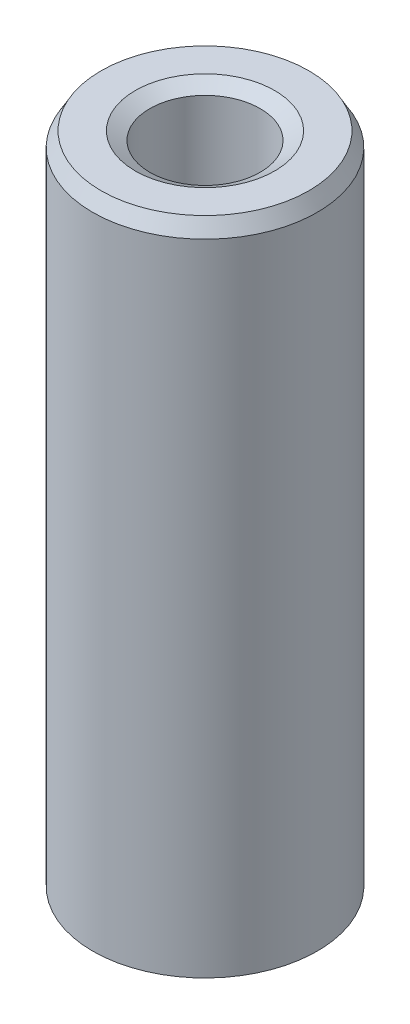
ISO-10303-21;
HEADER;
FILE_DESCRIPTION(('STEP AP214'),'2;1');
FILE_NAME('part.step','',(''),(''),'','','');
FILE_SCHEMA(('AUTOMOTIVE_DESIGN { 1 0 10303 214 1 1 1 1 }'));
ENDSEC;
DATA;
#1=APPLICATION_CONTEXT('core data for automotive mechanical design processes');
#2=APPLICATION_PROTOCOL_DEFINITION('international standard','automotive_design',2000,#1);
#3=PRODUCT_CONTEXT('',#1,'mechanical');
#4=PRODUCT('Part','Part','',(#3));
#5=PRODUCT_RELATED_PRODUCT_CATEGORY('part','',(#4));
#6=PRODUCT_DEFINITION_FORMATION('','',#4);
#7=PRODUCT_DEFINITION_CONTEXT('part definition',#1,'design');
#8=PRODUCT_DEFINITION('design','',#6,#7);
#9=PRODUCT_DEFINITION_SHAPE('','',#8);
#10=(LENGTH_UNIT() NAMED_UNIT(*) SI_UNIT(.MILLI.,.METRE.));
#11=(NAMED_UNIT(*) PLANE_ANGLE_UNIT() SI_UNIT($,.RADIAN.));
#12=(NAMED_UNIT(*) SI_UNIT($,.STERADIAN.) SOLID_ANGLE_UNIT());
#13=UNCERTAINTY_MEASURE_WITH_UNIT(LENGTH_MEASURE(1.E-05),#10,'distance_accuracy_value','');
#14=(GEOMETRIC_REPRESENTATION_CONTEXT(3) GLOBAL_UNCERTAINTY_ASSIGNED_CONTEXT((#13)) GLOBAL_UNIT_ASSIGNED_CONTEXT((#10,
#11,#12)) REPRESENTATION_CONTEXT('',''));
#15=CARTESIAN_POINT('',(0.,0.,0.));
#16=DIRECTION('',(0.,0.,1.));
#17=DIRECTION('',(1.,0.,0.));
#18=AXIS2_PLACEMENT_3D('',#15,#16,#17);
#19=CARTESIAN_POINT('',(0.,118.010384903791,0.));
#20=DIRECTION('',(0.,-1.,0.));
#21=DIRECTION('',(0.,0.,-1.));
#22=AXIS2_PLACEMENT_3D('',#19,#20,#21);
#23=CYLINDRICAL_SURFACE('',#22,20.);
#24=CARTESIAN_POINT('',(0.,1.49350604881163,0.));
#25=DIRECTION('',(0.,1.,0.));
#26=DIRECTION('',(0.,0.,1.));
#27=AXIS2_PLACEMENT_3D('',#24,#25,#26);
#28=CIRCLE('',#27,20.);
#29=CARTESIAN_POINT('',(0.,1.49350604881163,20.));
#30=VERTEX_POINT('',#29);
#31=EDGE_CURVE('E10',#30,#30,#28,.T.);
#32=ORIENTED_EDGE('',*,*,#31,.T.);
#33=EDGE_LOOP('',(#32));
#34=FACE_BOUND('',#33,.T.);
#35=CARTESIAN_POINT('',(0.,115.423556545838,0.));
#36=DIRECTION('',(0.,1.,0.));
#37=DIRECTION('',(0.,0.,1.));
#38=AXIS2_PLACEMENT_3D('',#35,#36,#37);
#39=CIRCLE('',#38,20.);
#40=CARTESIAN_POINT('',(0.,115.423556545838,20.));
#41=VERTEX_POINT('',#40);
#42=EDGE_CURVE('E50',#41,#41,#39,.F.);
#43=ORIENTED_EDGE('',*,*,#42,.T.);
#44=EDGE_LOOP('',(#43));
#45=FACE_BOUND('',#44,.T.);
#46=ADVANCED_FACE('F39',(#34,#45),#23,.T.);
#47=CARTESIAN_POINT('',(0.,118.010384903791,0.));
#48=DIRECTION('',(0.,1.,0.));
#49=DIRECTION('',(0.,0.,1.));
#50=AXIS2_PLACEMENT_3D('',#47,#48,#49);
#51=PLANE('',#50);
#52=CARTESIAN_POINT('',(0.,118.010384903791,0.));
#53=DIRECTION('',(0.,1.,0.));
#54=DIRECTION('',(0.,0.,1.));
#55=AXIS2_PLACEMENT_3D('',#52,#53,#54);
#56=CIRCLE('',#55,12.4172702866441);
#57=CARTESIAN_POINT('',(0.,118.010384903791,12.4172702866441));
#58=VERTEX_POINT('',#57);
#59=EDGE_CURVE('E58',#58,#58,#56,.F.);
#60=ORIENTED_EDGE('',*,*,#59,.T.);
#61=EDGE_LOOP('',(#60));
#62=FACE_BOUND('',#61,.T.);
#63=CARTESIAN_POINT('',(0.,118.010384903791,0.));
#64=DIRECTION('',(0.,1.,0.));
#65=DIRECTION('',(0.,0.,1.));
#66=AXIS2_PLACEMENT_3D('',#63,#64,#65);
#67=CIRCLE('',#66,18.5064939511884);
#68=CARTESIAN_POINT('',(0.,118.010384903791,18.5064939511884));
#69=VERTEX_POINT('',#68);
#70=EDGE_CURVE('E61',#69,#69,#67,.T.);
#71=ORIENTED_EDGE('',*,*,#70,.T.);
#72=EDGE_LOOP('',(#71));
#73=FACE_BOUND('',#72,.T.);
#74=ADVANCED_FACE('F88',(#62,#73),#51,.T.);
#75=CARTESIAN_POINT('',(0.,0.,0.));
#76=DIRECTION('',(0.,1.,0.));
#77=DIRECTION('',(0.,0.,1.));
#78=AXIS2_PLACEMENT_3D('',#75,#76,#77);
#79=PLANE('',#78);
#80=CARTESIAN_POINT('',(0.,0.,0.));
#81=DIRECTION('',(0.,1.,0.));
#82=DIRECTION('',(0.,0.,1.));
#83=AXIS2_PLACEMENT_3D('',#80,#81,#82);
#84=CIRCLE('',#83,11.3239479775025);
#85=CARTESIAN_POINT('',(0.,0.,11.3239479775025));
#86=VERTEX_POINT('',#85);
#87=EDGE_CURVE('E51',#86,#86,#84,.T.);
#88=ORIENTED_EDGE('',*,*,#87,.T.);
#89=EDGE_LOOP('',(#88));
#90=FACE_BOUND('',#89,.T.);
#91=CARTESIAN_POINT('',(0.,0.,0.));
#92=DIRECTION('',(0.,1.,0.));
#93=DIRECTION('',(0.,0.,1.));
#94=AXIS2_PLACEMENT_3D('',#91,#92,#93);
#95=CIRCLE('',#94,17.4131716420468);
#96=CARTESIAN_POINT('',(0.,0.,17.4131716420468));
#97=VERTEX_POINT('',#96);
#98=EDGE_CURVE('E54',#97,#97,#95,.F.);
#99=ORIENTED_EDGE('',*,*,#98,.T.);
#100=EDGE_LOOP('',(#99));
#101=FACE_BOUND('',#100,.T.);
#102=ADVANCED_FACE('F83',(#90,#101),#79,.F.);
#103=CARTESIAN_POINT('',(0.,118.010384903791,0.));
#104=DIRECTION('',(0.,-1.,0.));
#105=DIRECTION('',(0.,0.,-1.));
#106=AXIS2_PLACEMENT_3D('',#103,#104,#105);
#107=CYLINDRICAL_SURFACE('',#106,9.8304419286909);
#108=CARTESIAN_POINT('',(0.,116.51687885498,0.));
#109=DIRECTION('',(0.,1.,0.));
#110=DIRECTION('',(0.,0.,1.));
#111=AXIS2_PLACEMENT_3D('',#108,#109,#110);
#112=CIRCLE('',#111,9.8304419286909);
#113=CARTESIAN_POINT('',(0.,116.51687885498,9.8304419286909));
#114=VERTEX_POINT('',#113);
#115=EDGE_CURVE('E67',#114,#114,#112,.T.);
#116=ORIENTED_EDGE('',*,*,#115,.T.);
#117=EDGE_LOOP('',(#116));
#118=FACE_BOUND('',#117,.T.);
#119=CARTESIAN_POINT('',(0.,2.58682835795322,0.));
#120=DIRECTION('',(0.,1.,0.));
#121=DIRECTION('',(0.,0.,1.));
#122=AXIS2_PLACEMENT_3D('',#119,#120,#121);
#123=CIRCLE('',#122,9.8304419286909);
#124=CARTESIAN_POINT('',(0.,2.58682835795322,9.8304419286909));
#125=VERTEX_POINT('',#124);
#126=EDGE_CURVE('E69',#125,#125,#123,.F.);
#127=ORIENTED_EDGE('',*,*,#126,.T.);
#128=EDGE_LOOP('',(#127));
#129=FACE_BOUND('',#128,.T.);
#130=ADVANCED_FACE('F71',(#118,#129),#107,.F.);
#131=CARTESIAN_POINT('',(0.,116.51687885498,0.));
#132=DIRECTION('',(0.,1.,0.));
#133=DIRECTION('',(0.,0.,1.));
#134=AXIS2_PLACEMENT_3D('',#131,#132,#133);
#135=CONICAL_SURFACE('',#134,9.8304419286909,1.04719755119661);
#136=ORIENTED_EDGE('',*,*,#59,.F.);
#137=EDGE_LOOP('',(#136));
#138=FACE_BOUND('',#137,.T.);
#139=ORIENTED_EDGE('',*,*,#115,.F.);
#140=EDGE_LOOP('',(#139));
#141=FACE_BOUND('',#140,.T.);
#142=ADVANCED_FACE('F77',(#138,#141),#135,.F.);
#143=CARTESIAN_POINT('',(0.,0.,0.));
#144=DIRECTION('',(0.,-1.,0.));
#145=DIRECTION('',(0.,0.,-1.));
#146=AXIS2_PLACEMENT_3D('',#143,#144,#145);
#147=CONICAL_SURFACE('',#146,11.3239479775025,0.523598775598295);
#148=ORIENTED_EDGE('',*,*,#126,.F.);
#149=EDGE_LOOP('',(#148));
#150=FACE_BOUND('',#149,.T.);
#151=ORIENTED_EDGE('',*,*,#87,.F.);
#152=EDGE_LOOP('',(#151));
#153=FACE_BOUND('',#152,.T.);
#154=ADVANCED_FACE('F73',(#150,#153),#147,.F.);
#155=CARTESIAN_POINT('',(0.,1.49350604881163,0.));
#156=DIRECTION('',(0.,1.,0.));
#157=DIRECTION('',(0.,0.,1.));
#158=AXIS2_PLACEMENT_3D('',#155,#156,#157);
#159=CONICAL_SURFACE('',#158,20.,1.0471975511966);
#160=ORIENTED_EDGE('',*,*,#98,.F.);
#161=EDGE_LOOP('',(#160));
#162=FACE_BOUND('',#161,.T.);
#163=ORIENTED_EDGE('',*,*,#31,.F.);
#164=EDGE_LOOP('',(#163));
#165=FACE_BOUND('',#164,.T.);
#166=ADVANCED_FACE('F76',(#162,#165),#159,.T.);
#167=CARTESIAN_POINT('',(0.,118.010384903791,0.));
#168=DIRECTION('',(0.,-1.,0.));
#169=DIRECTION('',(0.,0.,-1.));
#170=AXIS2_PLACEMENT_3D('',#167,#168,#169);
#171=CONICAL_SURFACE('',#170,18.5064939511884,0.5235987755983);
#172=ORIENTED_EDGE('',*,*,#42,.F.);
#173=EDGE_LOOP('',(#172));
#174=FACE_BOUND('',#173,.T.);
#175=ORIENTED_EDGE('',*,*,#70,.F.);
#176=EDGE_LOOP('',(#175));
#177=FACE_BOUND('',#176,.T.);
#178=ADVANCED_FACE('F45',(#174,#177),#171,.T.);
#179=CLOSED_SHELL('',(#46,#74,#102,#130,#142,#154,#166,#178));
#180=MANIFOLD_SOLID_BREP('B2',#179);
#181=ADVANCED_BREP_SHAPE_REPRESENTATION('',(#18,#180),#14);
#182=SHAPE_DEFINITION_REPRESENTATION(#9,#181);
ENDSEC;
END-ISO-10303-21;
